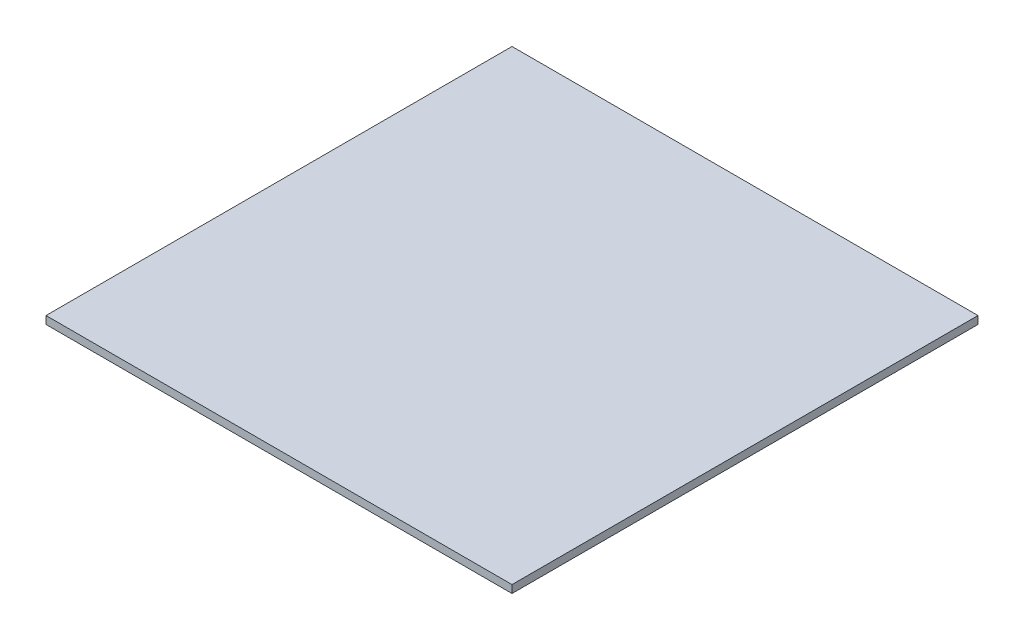
ISO-10303-21;
HEADER;
FILE_DESCRIPTION(('STEP AP214'),'2;1');
FILE_NAME('part.step','',(''),(''),'','','');
FILE_SCHEMA(('AUTOMOTIVE_DESIGN { 1 0 10303 214 1 1 1 1 }'));
ENDSEC;
DATA;
#1=APPLICATION_CONTEXT('core data for automotive mechanical design processes');
#2=APPLICATION_PROTOCOL_DEFINITION('international standard','automotive_design',2000,#1);
#3=PRODUCT_CONTEXT('',#1,'mechanical');
#4=PRODUCT('Part','Part','',(#3));
#5=PRODUCT_RELATED_PRODUCT_CATEGORY('part','',(#4));
#6=PRODUCT_DEFINITION_FORMATION('','',#4);
#7=PRODUCT_DEFINITION_CONTEXT('part definition',#1,'design');
#8=PRODUCT_DEFINITION('design','',#6,#7);
#9=PRODUCT_DEFINITION_SHAPE('','',#8);
#10=(LENGTH_UNIT() NAMED_UNIT(*) SI_UNIT(.MILLI.,.METRE.));
#11=(NAMED_UNIT(*) PLANE_ANGLE_UNIT() SI_UNIT($,.RADIAN.));
#12=(NAMED_UNIT(*) SI_UNIT($,.STERADIAN.) SOLID_ANGLE_UNIT());
#13=UNCERTAINTY_MEASURE_WITH_UNIT(LENGTH_MEASURE(1.E-05),#10,'distance_accuracy_value','');
#14=(GEOMETRIC_REPRESENTATION_CONTEXT(3) GLOBAL_UNCERTAINTY_ASSIGNED_CONTEXT((#13)) GLOBAL_UNIT_ASSIGNED_CONTEXT((#10,
#11,#12)) REPRESENTATION_CONTEXT('',''));
#15=CARTESIAN_POINT('',(0.,0.,0.));
#16=DIRECTION('',(0.,0.,1.));
#17=DIRECTION('',(1.,0.,0.));
#18=AXIS2_PLACEMENT_3D('',#15,#16,#17);
#19=CARTESIAN_POINT('',(0.,5.,0.));
#20=DIRECTION('',(1.,0.,0.));
#21=DIRECTION('',(0.,0.,-1.));
#22=AXIS2_PLACEMENT_3D('',#19,#20,#21);
#23=PLANE('',#22);
#24=DIRECTION('',(0.,0.,1.));
#25=VECTOR('',#24,1.);
#26=CARTESIAN_POINT('',(0.,0.,0.));
#27=LINE('',#26,#25);
#28=CARTESIAN_POINT('',(0.,0.,0.));
#29=VERTEX_POINT('',#28);
#30=CARTESIAN_POINT('',(0.,0.,300.));
#31=VERTEX_POINT('',#30);
#32=EDGE_CURVE('E96',#29,#31,#27,.T.);
#33=ORIENTED_EDGE('',*,*,#32,.T.);
#34=DIRECTION('',(0.,-1.,0.));
#35=VECTOR('',#34,1.);
#36=CARTESIAN_POINT('',(0.,5.,300.));
#37=LINE('',#36,#35);
#38=CARTESIAN_POINT('',(0.,5.,300.));
#39=VERTEX_POINT('',#38);
#40=EDGE_CURVE('E11',#39,#31,#37,.T.);
#41=ORIENTED_EDGE('',*,*,#40,.F.);
#42=DIRECTION('',(0.,0.,1.));
#43=VECTOR('',#42,1.);
#44=CARTESIAN_POINT('',(0.,5.,0.));
#45=LINE('',#44,#43);
#46=CARTESIAN_POINT('',(0.,5.,0.));
#47=VERTEX_POINT('',#46);
#48=EDGE_CURVE('E84',#47,#39,#45,.T.);
#49=ORIENTED_EDGE('',*,*,#48,.F.);
#50=DIRECTION('',(0.,-1.,0.));
#51=VECTOR('',#50,1.);
#52=CARTESIAN_POINT('',(0.,5.,0.));
#53=LINE('',#52,#51);
#54=EDGE_CURVE('E92',#47,#29,#53,.T.);
#55=ORIENTED_EDGE('',*,*,#54,.T.);
#56=EDGE_LOOP('',(#33,#41,#49,#55));
#57=FACE_BOUND('',#56,.T.);
#58=ADVANCED_FACE('F33',(#57),#23,.F.);
#59=CARTESIAN_POINT('',(0.,5.,300.));
#60=DIRECTION('',(0.,0.,-1.));
#61=DIRECTION('',(-1.,0.,0.));
#62=AXIS2_PLACEMENT_3D('',#59,#60,#61);
#63=PLANE('',#62);
#64=DIRECTION('',(1.,0.,0.));
#65=VECTOR('',#64,1.);
#66=CARTESIAN_POINT('',(0.,0.,300.));
#67=LINE('',#66,#65);
#68=CARTESIAN_POINT('',(300.,0.,300.));
#69=VERTEX_POINT('',#68);
#70=EDGE_CURVE('E88',#31,#69,#67,.T.);
#71=ORIENTED_EDGE('',*,*,#70,.T.);
#72=DIRECTION('',(0.,-1.,0.));
#73=VECTOR('',#72,1.);
#74=CARTESIAN_POINT('',(300.,5.,300.));
#75=LINE('',#74,#73);
#76=CARTESIAN_POINT('',(300.,5.,300.));
#77=VERTEX_POINT('',#76);
#78=EDGE_CURVE('E41',#77,#69,#75,.T.);
#79=ORIENTED_EDGE('',*,*,#78,.F.);
#80=DIRECTION('',(1.,0.,0.));
#81=VECTOR('',#80,1.);
#82=CARTESIAN_POINT('',(0.,5.,300.));
#83=LINE('',#82,#81);
#84=EDGE_CURVE('E79',#39,#77,#83,.T.);
#85=ORIENTED_EDGE('',*,*,#84,.F.);
#86=ORIENTED_EDGE('',*,*,#40,.T.);
#87=EDGE_LOOP('',(#71,#79,#85,#86));
#88=FACE_BOUND('',#87,.T.);
#89=ADVANCED_FACE('F87',(#88),#63,.F.);
#90=CARTESIAN_POINT('',(300.,5.,0.));
#91=DIRECTION('',(-1.,0.,0.));
#92=DIRECTION('',(0.,0.,1.));
#93=AXIS2_PLACEMENT_3D('',#90,#91,#92);
#94=PLANE('',#93);
#95=DIRECTION('',(0.,0.,-1.));
#96=VECTOR('',#95,1.);
#97=CARTESIAN_POINT('',(300.,0.,0.));
#98=LINE('',#97,#96);
#99=CARTESIAN_POINT('',(300.,0.,0.));
#100=VERTEX_POINT('',#99);
#101=EDGE_CURVE('E66',#69,#100,#98,.T.);
#102=ORIENTED_EDGE('',*,*,#101,.T.);
#103=DIRECTION('',(0.,-1.,0.));
#104=VECTOR('',#103,1.);
#105=CARTESIAN_POINT('',(300.,5.,0.));
#106=LINE('',#105,#104);
#107=CARTESIAN_POINT('',(300.,5.,0.));
#108=VERTEX_POINT('',#107);
#109=EDGE_CURVE('E89',#108,#100,#106,.T.);
#110=ORIENTED_EDGE('',*,*,#109,.F.);
#111=DIRECTION('',(0.,0.,-1.));
#112=VECTOR('',#111,1.);
#113=CARTESIAN_POINT('',(300.,5.,0.));
#114=LINE('',#113,#112);
#115=EDGE_CURVE('E82',#77,#108,#114,.T.);
#116=ORIENTED_EDGE('',*,*,#115,.F.);
#117=ORIENTED_EDGE('',*,*,#78,.T.);
#118=EDGE_LOOP('',(#102,#110,#116,#117));
#119=FACE_BOUND('',#118,.T.);
#120=ADVANCED_FACE('F90',(#119),#94,.F.);
#121=CARTESIAN_POINT('',(0.,5.,0.));
#122=DIRECTION('',(0.,0.,1.));
#123=DIRECTION('',(1.,0.,0.));
#124=AXIS2_PLACEMENT_3D('',#121,#122,#123);
#125=PLANE('',#124);
#126=DIRECTION('',(-1.,0.,0.));
#127=VECTOR('',#126,1.);
#128=CARTESIAN_POINT('',(0.,0.,0.));
#129=LINE('',#128,#127);
#130=EDGE_CURVE('E72',#100,#29,#129,.T.);
#131=ORIENTED_EDGE('',*,*,#130,.T.);
#132=ORIENTED_EDGE('',*,*,#54,.F.);
#133=DIRECTION('',(-1.,0.,0.));
#134=VECTOR('',#133,1.);
#135=CARTESIAN_POINT('',(0.,5.,0.));
#136=LINE('',#135,#134);
#137=EDGE_CURVE('E49',#108,#47,#136,.T.);
#138=ORIENTED_EDGE('',*,*,#137,.F.);
#139=ORIENTED_EDGE('',*,*,#109,.T.);
#140=EDGE_LOOP('',(#131,#132,#138,#139));
#141=FACE_BOUND('',#140,.T.);
#142=ADVANCED_FACE('F103',(#141),#125,.F.);
#143=CARTESIAN_POINT('',(0.,5.,0.));
#144=DIRECTION('',(0.,1.,0.));
#145=DIRECTION('',(0.,0.,1.));
#146=AXIS2_PLACEMENT_3D('',#143,#144,#145);
#147=PLANE('',#146);
#148=ORIENTED_EDGE('',*,*,#48,.T.);
#149=ORIENTED_EDGE('',*,*,#84,.T.);
#150=ORIENTED_EDGE('',*,*,#115,.T.);
#151=ORIENTED_EDGE('',*,*,#137,.T.);
#152=EDGE_LOOP('',(#148,#149,#150,#151));
#153=FACE_BOUND('',#152,.T.);
#154=ADVANCED_FACE('F80',(#153),#147,.T.);
#155=CARTESIAN_POINT('',(0.,0.,0.));
#156=DIRECTION('',(0.,1.,0.));
#157=DIRECTION('',(0.,0.,1.));
#158=AXIS2_PLACEMENT_3D('',#155,#156,#157);
#159=PLANE('',#158);
#160=ORIENTED_EDGE('',*,*,#32,.F.);
#161=ORIENTED_EDGE('',*,*,#130,.F.);
#162=ORIENTED_EDGE('',*,*,#101,.F.);
#163=ORIENTED_EDGE('',*,*,#70,.F.);
#164=EDGE_LOOP('',(#160,#161,#162,#163));
#165=FACE_BOUND('',#164,.T.);
#166=ADVANCED_FACE('F106',(#165),#159,.F.);
#167=CLOSED_SHELL('',(#58,#89,#120,#142,#154,#166));
#168=MANIFOLD_SOLID_BREP('B2',#167);
#169=ADVANCED_BREP_SHAPE_REPRESENTATION('',(#18,#168),#14);
#170=SHAPE_DEFINITION_REPRESENTATION(#9,#169);
ENDSEC;
END-ISO-10303-21;
